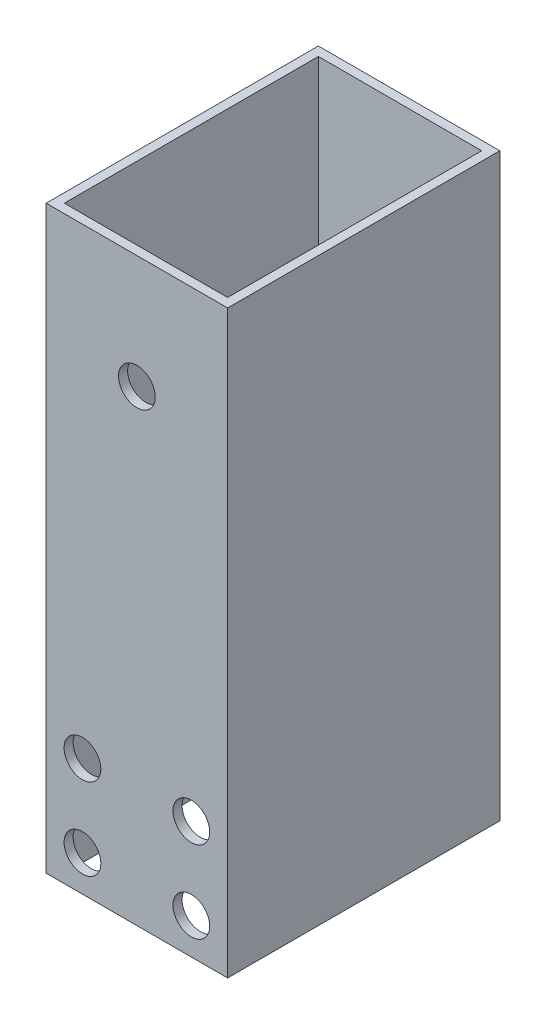
ISO-10303-21;
HEADER;
FILE_DESCRIPTION(('STEP AP214'),'2;1');
FILE_NAME('part.step','',(''),(''),'','','');
FILE_SCHEMA(('AUTOMOTIVE_DESIGN { 1 0 10303 214 1 1 1 1 }'));
ENDSEC;
DATA;
#1=APPLICATION_CONTEXT('core data for automotive mechanical design processes');
#2=APPLICATION_PROTOCOL_DEFINITION('international standard','automotive_design',2000,#1);
#3=PRODUCT_CONTEXT('',#1,'mechanical');
#4=PRODUCT('Part','Part','',(#3));
#5=PRODUCT_RELATED_PRODUCT_CATEGORY('part','',(#4));
#6=PRODUCT_DEFINITION_FORMATION('','',#4);
#7=PRODUCT_DEFINITION_CONTEXT('part definition',#1,'design');
#8=PRODUCT_DEFINITION('design','',#6,#7);
#9=PRODUCT_DEFINITION_SHAPE('','',#8);
#10=(LENGTH_UNIT() NAMED_UNIT(*) SI_UNIT(.MILLI.,.METRE.));
#11=(NAMED_UNIT(*) PLANE_ANGLE_UNIT() SI_UNIT($,.RADIAN.));
#12=(NAMED_UNIT(*) SI_UNIT($,.STERADIAN.) SOLID_ANGLE_UNIT());
#13=UNCERTAINTY_MEASURE_WITH_UNIT(LENGTH_MEASURE(1.E-05),#10,'distance_accuracy_value','');
#14=(GEOMETRIC_REPRESENTATION_CONTEXT(3) GLOBAL_UNCERTAINTY_ASSIGNED_CONTEXT((#13)) GLOBAL_UNIT_ASSIGNED_CONTEXT((#10,
#11,#12)) REPRESENTATION_CONTEXT('',''));
#15=CARTESIAN_POINT('',(0.,0.,0.));
#16=DIRECTION('',(0.,0.,1.));
#17=DIRECTION('',(1.,0.,0.));
#18=AXIS2_PLACEMENT_3D('',#15,#16,#17);
#19=CARTESIAN_POINT('',(10.,61.5,15.));
#20=DIRECTION('',(-1.,0.,0.));
#21=DIRECTION('',(0.,0.,1.));
#22=AXIS2_PLACEMENT_3D('',#19,#20,#21);
#23=PLANE('',#22);
#24=DIRECTION('',(0.,-1.,0.));
#25=VECTOR('',#24,1.);
#26=CARTESIAN_POINT('',(10.,61.5,-15.));
#27=LINE('',#26,#25);
#28=CARTESIAN_POINT('',(10.,2.45,-15.));
#29=VERTEX_POINT('',#28);
#30=CARTESIAN_POINT('',(10.,-61.5,-15.));
#31=VERTEX_POINT('',#30);
#32=EDGE_CURVE('E43',#29,#31,#27,.T.);
#33=ORIENTED_EDGE('',*,*,#32,.F.);
#34=DIRECTION('',(0.,0.,1.));
#35=VECTOR('',#34,1.);
#36=CARTESIAN_POINT('',(10.,2.45,-15.));
#37=LINE('',#36,#35);
#38=CARTESIAN_POINT('',(10.,2.45,15.));
#39=VERTEX_POINT('',#38);
#40=EDGE_CURVE('E101',#29,#39,#37,.T.);
#41=ORIENTED_EDGE('',*,*,#40,.T.);
#42=DIRECTION('',(0.,-1.,0.));
#43=VECTOR('',#42,1.);
#44=CARTESIAN_POINT('',(10.,61.5,15.));
#45=LINE('',#44,#43);
#46=CARTESIAN_POINT('',(10.,-61.5,15.));
#47=VERTEX_POINT('',#46);
#48=EDGE_CURVE('E121',#39,#47,#45,.T.);
#49=ORIENTED_EDGE('',*,*,#48,.T.);
#50=DIRECTION('',(0.,0.,-1.));
#51=VECTOR('',#50,1.);
#52=CARTESIAN_POINT('',(10.,-61.5,15.));
#53=LINE('',#52,#51);
#54=EDGE_CURVE('E193',#47,#31,#53,.T.);
#55=ORIENTED_EDGE('',*,*,#54,.T.);
#56=EDGE_LOOP('',(#33,#41,#49,#55));
#57=FACE_BOUND('',#56,.T.);
#58=ADVANCED_FACE('F35',(#57),#23,.F.);
#59=CARTESIAN_POINT('',(-10.,61.5,-15.));
#60=DIRECTION('',(0.,0.,1.));
#61=DIRECTION('',(1.,0.,0.));
#62=AXIS2_PLACEMENT_3D('',#59,#60,#61);
#63=PLANE('',#62);
#64=CARTESIAN_POINT('',(0.,-10.05,-15.));
#65=DIRECTION('',(0.,0.,1.));
#66=DIRECTION('',(1.,0.,0.));
#67=AXIS2_PLACEMENT_3D('',#64,#65,#66);
#68=CIRCLE('',#67,2.025);
#69=CARTESIAN_POINT('',(2.025,-10.05,-15.));
#70=VERTEX_POINT('',#69);
#71=EDGE_CURVE('E242',#70,#70,#68,.T.);
#72=ORIENTED_EDGE('',*,*,#71,.T.);
#73=EDGE_LOOP('',(#72));
#74=FACE_BOUND('',#73,.T.);
#75=CARTESIAN_POINT('',(-6.,-57.55,-15.));
#76=DIRECTION('',(0.,0.,1.));
#77=DIRECTION('',(1.,0.,0.));
#78=AXIS2_PLACEMENT_3D('',#75,#76,#77);
#79=CIRCLE('',#78,2.025);
#80=CARTESIAN_POINT('',(-3.975,-57.55,-15.));
#81=VERTEX_POINT('',#80);
#82=EDGE_CURVE('E137',#81,#81,#79,.T.);
#83=ORIENTED_EDGE('',*,*,#82,.T.);
#84=EDGE_LOOP('',(#83));
#85=FACE_BOUND('',#84,.T.);
#86=CARTESIAN_POINT('',(6.,-57.55,-15.));
#87=DIRECTION('',(0.,0.,1.));
#88=DIRECTION('',(1.,0.,0.));
#89=AXIS2_PLACEMENT_3D('',#86,#87,#88);
#90=CIRCLE('',#89,2.025);
#91=CARTESIAN_POINT('',(8.025,-57.55,-15.));
#92=VERTEX_POINT('',#91);
#93=EDGE_CURVE('E249',#92,#92,#90,.T.);
#94=ORIENTED_EDGE('',*,*,#93,.T.);
#95=EDGE_LOOP('',(#94));
#96=FACE_BOUND('',#95,.T.);
#97=CARTESIAN_POINT('',(-6.,-48.55,-15.));
#98=DIRECTION('',(0.,0.,1.));
#99=DIRECTION('',(1.,0.,0.));
#100=AXIS2_PLACEMENT_3D('',#97,#98,#99);
#101=CIRCLE('',#100,2.025);
#102=CARTESIAN_POINT('',(-3.975,-48.55,-15.));
#103=VERTEX_POINT('',#102);
#104=EDGE_CURVE('E129',#103,#103,#101,.T.);
#105=ORIENTED_EDGE('',*,*,#104,.T.);
#106=EDGE_LOOP('',(#105));
#107=FACE_BOUND('',#106,.T.);
#108=CARTESIAN_POINT('',(6.,-48.55,-15.));
#109=DIRECTION('',(0.,0.,1.));
#110=DIRECTION('',(1.,0.,0.));
#111=AXIS2_PLACEMENT_3D('',#108,#109,#110);
#112=CIRCLE('',#111,2.025);
#113=CARTESIAN_POINT('',(8.02500000000001,-48.55,-15.));
#114=VERTEX_POINT('',#113);
#115=EDGE_CURVE('E168',#114,#114,#112,.T.);
#116=ORIENTED_EDGE('',*,*,#115,.T.);
#117=EDGE_LOOP('',(#116));
#118=FACE_BOUND('',#117,.T.);
#119=DIRECTION('',(0.,-1.,0.));
#120=VECTOR('',#119,1.);
#121=CARTESIAN_POINT('',(-10.,61.5,-15.));
#122=LINE('',#121,#120);
#123=CARTESIAN_POINT('',(-10.,2.45,-15.));
#124=VERTEX_POINT('',#123);
#125=CARTESIAN_POINT('',(-10.,-61.5,-15.));
#126=VERTEX_POINT('',#125);
#127=EDGE_CURVE('E111',#124,#126,#122,.T.);
#128=ORIENTED_EDGE('',*,*,#127,.F.);
#129=DIRECTION('',(1.,0.,0.));
#130=VECTOR('',#129,1.);
#131=CARTESIAN_POINT('',(10.,2.45,-15.));
#132=LINE('',#131,#130);
#133=EDGE_CURVE('E98',#124,#29,#132,.T.);
#134=ORIENTED_EDGE('',*,*,#133,.T.);
#135=ORIENTED_EDGE('',*,*,#32,.T.);
#136=DIRECTION('',(-1.,0.,0.));
#137=VECTOR('',#136,1.);
#138=CARTESIAN_POINT('',(-10.,-61.5,-15.));
#139=LINE('',#138,#137);
#140=EDGE_CURVE('E117',#31,#126,#139,.T.);
#141=ORIENTED_EDGE('',*,*,#140,.T.);
#142=EDGE_LOOP('',(#128,#134,#135,#141));
#143=FACE_BOUND('',#142,.T.);
#144=ADVANCED_FACE('F115',(#74,#85,#96,#107,#118,#143),#63,.F.);
#145=CARTESIAN_POINT('',(-10.,61.5,15.));
#146=DIRECTION('',(1.,0.,0.));
#147=DIRECTION('',(0.,0.,-1.));
#148=AXIS2_PLACEMENT_3D('',#145,#146,#147);
#149=PLANE('',#148);
#150=DIRECTION('',(0.,-1.,0.));
#151=VECTOR('',#150,1.);
#152=CARTESIAN_POINT('',(-10.,61.5,15.));
#153=LINE('',#152,#151);
#154=CARTESIAN_POINT('',(-10.,2.44999999999999,15.));
#155=VERTEX_POINT('',#154);
#156=CARTESIAN_POINT('',(-10.,-61.5,15.));
#157=VERTEX_POINT('',#156);
#158=EDGE_CURVE('E113',#155,#157,#153,.T.);
#159=ORIENTED_EDGE('',*,*,#158,.F.);
#160=DIRECTION('',(0.,0.,1.));
#161=VECTOR('',#160,1.);
#162=CARTESIAN_POINT('',(-10.,2.45,-15.));
#163=LINE('',#162,#161);
#164=EDGE_CURVE('E51',#124,#155,#163,.T.);
#165=ORIENTED_EDGE('',*,*,#164,.F.);
#166=ORIENTED_EDGE('',*,*,#127,.T.);
#167=DIRECTION('',(0.,0.,1.));
#168=VECTOR('',#167,1.);
#169=CARTESIAN_POINT('',(-10.,-61.5,15.));
#170=LINE('',#169,#168);
#171=EDGE_CURVE('E205',#126,#157,#170,.T.);
#172=ORIENTED_EDGE('',*,*,#171,.T.);
#173=EDGE_LOOP('',(#159,#165,#166,#172));
#174=FACE_BOUND('',#173,.T.);
#175=ADVANCED_FACE('F109',(#174),#149,.F.);
#176=CARTESIAN_POINT('',(-10.,61.5,15.));
#177=DIRECTION('',(0.,0.,-1.));
#178=DIRECTION('',(-1.,0.,0.));
#179=AXIS2_PLACEMENT_3D('',#176,#177,#178);
#180=PLANE('',#179);
#181=CARTESIAN_POINT('',(0.,-10.05,15.));
#182=DIRECTION('',(0.,0.,1.));
#183=DIRECTION('',(1.,0.,0.));
#184=AXIS2_PLACEMENT_3D('',#181,#182,#183);
#185=CIRCLE('',#184,2.025);
#186=CARTESIAN_POINT('',(2.025,-10.05,15.));
#187=VERTEX_POINT('',#186);
#188=EDGE_CURVE('E427',#187,#187,#185,.T.);
#189=ORIENTED_EDGE('',*,*,#188,.F.);
#190=EDGE_LOOP('',(#189));
#191=FACE_BOUND('',#190,.T.);
#192=CARTESIAN_POINT('',(-6.,-57.55,15.));
#193=DIRECTION('',(0.,0.,1.));
#194=DIRECTION('',(1.,0.,0.));
#195=AXIS2_PLACEMENT_3D('',#192,#193,#194);
#196=CIRCLE('',#195,2.025);
#197=CARTESIAN_POINT('',(-3.975,-57.55,15.));
#198=VERTEX_POINT('',#197);
#199=EDGE_CURVE('E438',#198,#198,#196,.T.);
#200=ORIENTED_EDGE('',*,*,#199,.F.);
#201=EDGE_LOOP('',(#200));
#202=FACE_BOUND('',#201,.T.);
#203=CARTESIAN_POINT('',(6.,-57.55,15.));
#204=DIRECTION('',(0.,0.,1.));
#205=DIRECTION('',(1.,0.,0.));
#206=AXIS2_PLACEMENT_3D('',#203,#204,#205);
#207=CIRCLE('',#206,2.025);
#208=CARTESIAN_POINT('',(8.025,-57.55,15.));
#209=VERTEX_POINT('',#208);
#210=EDGE_CURVE('E150',#209,#209,#207,.T.);
#211=ORIENTED_EDGE('',*,*,#210,.F.);
#212=EDGE_LOOP('',(#211));
#213=FACE_BOUND('',#212,.T.);
#214=CARTESIAN_POINT('',(-6.,-48.55,15.));
#215=DIRECTION('',(0.,0.,1.));
#216=DIRECTION('',(1.,0.,0.));
#217=AXIS2_PLACEMENT_3D('',#214,#215,#216);
#218=CIRCLE('',#217,2.025);
#219=CARTESIAN_POINT('',(-3.975,-48.55,15.));
#220=VERTEX_POINT('',#219);
#221=EDGE_CURVE('E165',#220,#220,#218,.T.);
#222=ORIENTED_EDGE('',*,*,#221,.F.);
#223=EDGE_LOOP('',(#222));
#224=FACE_BOUND('',#223,.T.);
#225=CARTESIAN_POINT('',(6.,-48.55,15.));
#226=DIRECTION('',(0.,0.,1.));
#227=DIRECTION('',(1.,0.,0.));
#228=AXIS2_PLACEMENT_3D('',#225,#226,#227);
#229=CIRCLE('',#228,2.025);
#230=CARTESIAN_POINT('',(8.02500000000001,-48.55,15.));
#231=VERTEX_POINT('',#230);
#232=EDGE_CURVE('E162',#231,#231,#229,.T.);
#233=ORIENTED_EDGE('',*,*,#232,.F.);
#234=EDGE_LOOP('',(#233));
#235=FACE_BOUND('',#234,.T.);
#236=ORIENTED_EDGE('',*,*,#48,.F.);
#237=DIRECTION('',(1.,0.,0.));
#238=VECTOR('',#237,1.);
#239=CARTESIAN_POINT('',(10.,2.45,15.));
#240=LINE('',#239,#238);
#241=EDGE_CURVE('E105',#155,#39,#240,.T.);
#242=ORIENTED_EDGE('',*,*,#241,.F.);
#243=ORIENTED_EDGE('',*,*,#158,.T.);
#244=DIRECTION('',(1.,0.,0.));
#245=VECTOR('',#244,1.);
#246=CARTESIAN_POINT('',(-10.,-61.5,15.));
#247=LINE('',#246,#245);
#248=EDGE_CURVE('E207',#157,#47,#247,.T.);
#249=ORIENTED_EDGE('',*,*,#248,.T.);
#250=EDGE_LOOP('',(#236,#242,#243,#249));
#251=FACE_BOUND('',#250,.T.);
#252=ADVANCED_FACE('F214',(#191,#202,#213,#224,#235,#251),#180,.F.);
#253=CARTESIAN_POINT('',(0.,-61.5,0.));
#254=DIRECTION('',(0.,-1.,0.));
#255=DIRECTION('',(0.,0.,-1.));
#256=AXIS2_PLACEMENT_3D('',#253,#254,#255);
#257=PLANE('',#256);
#258=DIRECTION('',(1.,0.,0.));
#259=VECTOR('',#258,1.);
#260=CARTESIAN_POINT('',(-9.,-61.5,14.));
#261=LINE('',#260,#259);
#262=CARTESIAN_POINT('',(-9.,-61.5,14.));
#263=VERTEX_POINT('',#262);
#264=CARTESIAN_POINT('',(9.,-61.5,14.));
#265=VERTEX_POINT('',#264);
#266=EDGE_CURVE('E177',#263,#265,#261,.T.);
#267=ORIENTED_EDGE('',*,*,#266,.T.);
#268=DIRECTION('',(0.,0.,-1.));
#269=VECTOR('',#268,1.);
#270=CARTESIAN_POINT('',(9.,-61.5,14.));
#271=LINE('',#270,#269);
#272=CARTESIAN_POINT('',(9.,-61.5,-14.));
#273=VERTEX_POINT('',#272);
#274=EDGE_CURVE('E180',#265,#273,#271,.T.);
#275=ORIENTED_EDGE('',*,*,#274,.T.);
#276=DIRECTION('',(-1.,0.,0.));
#277=VECTOR('',#276,1.);
#278=CARTESIAN_POINT('',(9.,-61.5,-14.));
#279=LINE('',#278,#277);
#280=CARTESIAN_POINT('',(-9.,-61.5,-14.));
#281=VERTEX_POINT('',#280);
#282=EDGE_CURVE('E183',#273,#281,#279,.T.);
#283=ORIENTED_EDGE('',*,*,#282,.T.);
#284=DIRECTION('',(0.,0.,1.));
#285=VECTOR('',#284,1.);
#286=CARTESIAN_POINT('',(-9.,-61.5,-14.));
#287=LINE('',#286,#285);
#288=EDGE_CURVE('E186',#281,#263,#287,.T.);
#289=ORIENTED_EDGE('',*,*,#288,.T.);
#290=EDGE_LOOP('',(#267,#275,#283,#289));
#291=FACE_BOUND('',#290,.T.);
#292=ORIENTED_EDGE('',*,*,#54,.F.);
#293=ORIENTED_EDGE('',*,*,#248,.F.);
#294=ORIENTED_EDGE('',*,*,#171,.F.);
#295=ORIENTED_EDGE('',*,*,#140,.F.);
#296=EDGE_LOOP('',(#292,#293,#294,#295));
#297=FACE_BOUND('',#296,.T.);
#298=ADVANCED_FACE('F216',(#291,#297),#257,.T.);
#299=CARTESIAN_POINT('',(-9.,-61.5,14.));
#300=DIRECTION('',(0.,0.,1.));
#301=DIRECTION('',(1.,0.,0.));
#302=AXIS2_PLACEMENT_3D('',#299,#300,#301);
#303=PLANE('',#302);
#304=CARTESIAN_POINT('',(0.,-10.05,14.));
#305=DIRECTION('',(0.,0.,1.));
#306=DIRECTION('',(1.,0.,0.));
#307=AXIS2_PLACEMENT_3D('',#304,#305,#306);
#308=CIRCLE('',#307,2.025);
#309=CARTESIAN_POINT('',(2.025,-10.05,14.));
#310=VERTEX_POINT('',#309);
#311=EDGE_CURVE('E430',#310,#310,#308,.T.);
#312=ORIENTED_EDGE('',*,*,#311,.T.);
#313=EDGE_LOOP('',(#312));
#314=FACE_BOUND('',#313,.T.);
#315=CARTESIAN_POINT('',(-6.,-57.55,14.));
#316=DIRECTION('',(0.,0.,1.));
#317=DIRECTION('',(1.,0.,0.));
#318=AXIS2_PLACEMENT_3D('',#315,#316,#317);
#319=CIRCLE('',#318,2.025);
#320=CARTESIAN_POINT('',(-3.975,-57.55,14.));
#321=VERTEX_POINT('',#320);
#322=EDGE_CURVE('E140',#321,#321,#319,.T.);
#323=ORIENTED_EDGE('',*,*,#322,.T.);
#324=EDGE_LOOP('',(#323));
#325=FACE_BOUND('',#324,.T.);
#326=CARTESIAN_POINT('',(6.,-57.55,14.));
#327=DIRECTION('',(0.,0.,1.));
#328=DIRECTION('',(1.,0.,0.));
#329=AXIS2_PLACEMENT_3D('',#326,#327,#328);
#330=CIRCLE('',#329,2.025);
#331=CARTESIAN_POINT('',(8.025,-57.55,14.));
#332=VERTEX_POINT('',#331);
#333=EDGE_CURVE('E136',#332,#332,#330,.T.);
#334=ORIENTED_EDGE('',*,*,#333,.T.);
#335=EDGE_LOOP('',(#334));
#336=FACE_BOUND('',#335,.T.);
#337=CARTESIAN_POINT('',(-6.,-48.55,14.));
#338=DIRECTION('',(0.,0.,1.));
#339=DIRECTION('',(1.,0.,0.));
#340=AXIS2_PLACEMENT_3D('',#337,#338,#339);
#341=CIRCLE('',#340,2.025);
#342=CARTESIAN_POINT('',(-3.975,-48.55,14.));
#343=VERTEX_POINT('',#342);
#344=EDGE_CURVE('E132',#343,#343,#341,.T.);
#345=ORIENTED_EDGE('',*,*,#344,.T.);
#346=EDGE_LOOP('',(#345));
#347=FACE_BOUND('',#346,.T.);
#348=CARTESIAN_POINT('',(6.,-48.55,14.));
#349=DIRECTION('',(0.,0.,1.));
#350=DIRECTION('',(1.,0.,0.));
#351=AXIS2_PLACEMENT_3D('',#348,#349,#350);
#352=CIRCLE('',#351,2.025);
#353=CARTESIAN_POINT('',(8.02500000000001,-48.55,14.));
#354=VERTEX_POINT('',#353);
#355=EDGE_CURVE('E128',#354,#354,#352,.T.);
#356=ORIENTED_EDGE('',*,*,#355,.T.);
#357=EDGE_LOOP('',(#356));
#358=FACE_BOUND('',#357,.T.);
#359=DIRECTION('',(0.,1.,0.));
#360=VECTOR('',#359,1.);
#361=CARTESIAN_POINT('',(-9.,-61.5,14.));
#362=LINE('',#361,#360);
#363=CARTESIAN_POINT('',(-9.,2.44999999999999,14.));
#364=VERTEX_POINT('',#363);
#365=EDGE_CURVE('E190',#263,#364,#362,.T.);
#366=ORIENTED_EDGE('',*,*,#365,.T.);
#367=DIRECTION('',(1.,0.,0.));
#368=VECTOR('',#367,1.);
#369=CARTESIAN_POINT('',(-9.00000000000001,2.44999999999999,14.));
#370=LINE('',#369,#368);
#371=CARTESIAN_POINT('',(9.,2.44999999999999,14.));
#372=VERTEX_POINT('',#371);
#373=EDGE_CURVE('E159',#364,#372,#370,.T.);
#374=ORIENTED_EDGE('',*,*,#373,.T.);
#375=DIRECTION('',(0.,1.,0.));
#376=VECTOR('',#375,1.);
#377=CARTESIAN_POINT('',(9.,-61.5,14.));
#378=LINE('',#377,#376);
#379=EDGE_CURVE('E189',#265,#372,#378,.T.);
#380=ORIENTED_EDGE('',*,*,#379,.F.);
#381=ORIENTED_EDGE('',*,*,#266,.F.);
#382=EDGE_LOOP('',(#366,#374,#380,#381));
#383=FACE_BOUND('',#382,.T.);
#384=ADVANCED_FACE('F218',(#314,#325,#336,#347,#358,#383),#303,.F.);
#385=CARTESIAN_POINT('',(-9.,-61.5,-14.));
#386=DIRECTION('',(-1.,0.,0.));
#387=DIRECTION('',(0.,0.,1.));
#388=AXIS2_PLACEMENT_3D('',#385,#386,#387);
#389=PLANE('',#388);
#390=DIRECTION('',(0.,1.,0.));
#391=VECTOR('',#390,1.);
#392=CARTESIAN_POINT('',(-9.,-61.5,-14.));
#393=LINE('',#392,#391);
#394=CARTESIAN_POINT('',(-9.,2.44999999999999,-14.));
#395=VERTEX_POINT('',#394);
#396=EDGE_CURVE('E194',#281,#395,#393,.T.);
#397=ORIENTED_EDGE('',*,*,#396,.T.);
#398=DIRECTION('',(0.,0.,1.));
#399=VECTOR('',#398,1.);
#400=CARTESIAN_POINT('',(-9.,2.44999999999999,-14.));
#401=LINE('',#400,#399);
#402=EDGE_CURVE('E156',#395,#364,#401,.T.);
#403=ORIENTED_EDGE('',*,*,#402,.T.);
#404=ORIENTED_EDGE('',*,*,#365,.F.);
#405=ORIENTED_EDGE('',*,*,#288,.F.);
#406=EDGE_LOOP('',(#397,#403,#404,#405));
#407=FACE_BOUND('',#406,.T.);
#408=ADVANCED_FACE('F225',(#407),#389,.F.);
#409=CARTESIAN_POINT('',(9.,-61.5,-14.));
#410=DIRECTION('',(0.,0.,-1.));
#411=DIRECTION('',(-1.,0.,0.));
#412=AXIS2_PLACEMENT_3D('',#409,#410,#411);
#413=PLANE('',#412);
#414=CARTESIAN_POINT('',(0.,-10.05,-14.));
#415=DIRECTION('',(0.,0.,-1.));
#416=DIRECTION('',(-1.,0.,0.));
#417=AXIS2_PLACEMENT_3D('',#414,#415,#416);
#418=CIRCLE('',#417,2.025);
#419=CARTESIAN_POINT('',(-2.025,-10.05,-14.));
#420=VERTEX_POINT('',#419);
#421=EDGE_CURVE('E38',#420,#420,#418,.T.);
#422=ORIENTED_EDGE('',*,*,#421,.T.);
#423=EDGE_LOOP('',(#422));
#424=FACE_BOUND('',#423,.T.);
#425=CARTESIAN_POINT('',(-6.,-57.55,-14.));
#426=DIRECTION('',(0.,0.,-1.));
#427=DIRECTION('',(-1.,0.,0.));
#428=AXIS2_PLACEMENT_3D('',#425,#426,#427);
#429=CIRCLE('',#428,2.025);
#430=CARTESIAN_POINT('',(-8.025,-57.55,-14.));
#431=VERTEX_POINT('',#430);
#432=EDGE_CURVE('E138',#431,#431,#429,.T.);
#433=ORIENTED_EDGE('',*,*,#432,.T.);
#434=EDGE_LOOP('',(#433));
#435=FACE_BOUND('',#434,.T.);
#436=CARTESIAN_POINT('',(6.,-57.55,-14.));
#437=DIRECTION('',(0.,0.,-1.));
#438=DIRECTION('',(-1.,0.,0.));
#439=AXIS2_PLACEMENT_3D('',#436,#437,#438);
#440=CIRCLE('',#439,2.025);
#441=CARTESIAN_POINT('',(3.975,-57.55,-14.));
#442=VERTEX_POINT('',#441);
#443=EDGE_CURVE('E134',#442,#442,#440,.T.);
#444=ORIENTED_EDGE('',*,*,#443,.T.);
#445=EDGE_LOOP('',(#444));
#446=FACE_BOUND('',#445,.T.);
#447=CARTESIAN_POINT('',(-6.,-48.55,-14.));
#448=DIRECTION('',(0.,0.,-1.));
#449=DIRECTION('',(-1.,0.,0.));
#450=AXIS2_PLACEMENT_3D('',#447,#448,#449);
#451=CIRCLE('',#450,2.025);
#452=CARTESIAN_POINT('',(-8.02500000000001,-48.55,-14.));
#453=VERTEX_POINT('',#452);
#454=EDGE_CURVE('E130',#453,#453,#451,.T.);
#455=ORIENTED_EDGE('',*,*,#454,.T.);
#456=EDGE_LOOP('',(#455));
#457=FACE_BOUND('',#456,.T.);
#458=CARTESIAN_POINT('',(6.,-48.55,-14.));
#459=DIRECTION('',(0.,0.,-1.));
#460=DIRECTION('',(-1.,0.,0.));
#461=AXIS2_PLACEMENT_3D('',#458,#459,#460);
#462=CIRCLE('',#461,2.025);
#463=CARTESIAN_POINT('',(3.975,-48.55,-14.));
#464=VERTEX_POINT('',#463);
#465=EDGE_CURVE('E125',#464,#464,#462,.T.);
#466=ORIENTED_EDGE('',*,*,#465,.T.);
#467=EDGE_LOOP('',(#466));
#468=FACE_BOUND('',#467,.T.);
#469=DIRECTION('',(0.,1.,0.));
#470=VECTOR('',#469,1.);
#471=CARTESIAN_POINT('',(9.,-61.5,-14.));
#472=LINE('',#471,#470);
#473=CARTESIAN_POINT('',(9.,2.44999999999999,-14.));
#474=VERTEX_POINT('',#473);
#475=EDGE_CURVE('E197',#273,#474,#472,.T.);
#476=ORIENTED_EDGE('',*,*,#475,.T.);
#477=DIRECTION('',(-1.,0.,0.));
#478=VECTOR('',#477,1.);
#479=CARTESIAN_POINT('',(8.99999999999999,2.44999999999999,-14.));
#480=LINE('',#479,#478);
#481=EDGE_CURVE('E59',#474,#395,#480,.T.);
#482=ORIENTED_EDGE('',*,*,#481,.T.);
#483=ORIENTED_EDGE('',*,*,#396,.F.);
#484=ORIENTED_EDGE('',*,*,#282,.F.);
#485=EDGE_LOOP('',(#476,#482,#483,#484));
#486=FACE_BOUND('',#485,.T.);
#487=ADVANCED_FACE('F263',(#424,#435,#446,#457,#468,#486),#413,.F.);
#488=CARTESIAN_POINT('',(9.,-61.5,14.));
#489=DIRECTION('',(1.,0.,0.));
#490=DIRECTION('',(0.,0.,-1.));
#491=AXIS2_PLACEMENT_3D('',#488,#489,#490);
#492=PLANE('',#491);
#493=ORIENTED_EDGE('',*,*,#379,.T.);
#494=DIRECTION('',(0.,0.,-1.));
#495=VECTOR('',#494,1.);
#496=CARTESIAN_POINT('',(9.,2.44999999999999,14.));
#497=LINE('',#496,#495);
#498=EDGE_CURVE('E11',#372,#474,#497,.T.);
#499=ORIENTED_EDGE('',*,*,#498,.T.);
#500=ORIENTED_EDGE('',*,*,#475,.F.);
#501=ORIENTED_EDGE('',*,*,#274,.F.);
#502=EDGE_LOOP('',(#493,#499,#500,#501));
#503=FACE_BOUND('',#502,.T.);
#504=ADVANCED_FACE('F258',(#503),#492,.F.);
#505=CARTESIAN_POINT('',(6.,-48.55,-15.));
#506=DIRECTION('',(0.,0.,1.));
#507=DIRECTION('',(1.,0.,0.));
#508=AXIS2_PLACEMENT_3D('',#505,#506,#507);
#509=CYLINDRICAL_SURFACE('',#508,2.025);
#510=ORIENTED_EDGE('',*,*,#115,.F.);
#511=EDGE_LOOP('',(#510));
#512=FACE_BOUND('',#511,.T.);
#513=ORIENTED_EDGE('',*,*,#465,.F.);
#514=EDGE_LOOP('',(#513));
#515=FACE_BOUND('',#514,.T.);
#516=ADVANCED_FACE('F254',(#512,#515),#509,.F.);
#517=CARTESIAN_POINT('',(-6.,-48.55,-15.));
#518=DIRECTION('',(0.,0.,1.));
#519=DIRECTION('',(1.,0.,0.));
#520=AXIS2_PLACEMENT_3D('',#517,#518,#519);
#521=CYLINDRICAL_SURFACE('',#520,2.025);
#522=ORIENTED_EDGE('',*,*,#104,.F.);
#523=EDGE_LOOP('',(#522));
#524=FACE_BOUND('',#523,.T.);
#525=ORIENTED_EDGE('',*,*,#454,.F.);
#526=EDGE_LOOP('',(#525));
#527=FACE_BOUND('',#526,.T.);
#528=ADVANCED_FACE('F257',(#524,#527),#521,.F.);
#529=ORIENTED_EDGE('',*,*,#232,.T.);
#530=EDGE_LOOP('',(#529));
#531=FACE_BOUND('',#530,.T.);
#532=ORIENTED_EDGE('',*,*,#355,.F.);
#533=EDGE_LOOP('',(#532));
#534=FACE_BOUND('',#533,.T.);
#535=ADVANCED_FACE('F260',(#531,#534),#509,.F.);
#536=ORIENTED_EDGE('',*,*,#221,.T.);
#537=EDGE_LOOP('',(#536));
#538=FACE_BOUND('',#537,.T.);
#539=ORIENTED_EDGE('',*,*,#344,.F.);
#540=EDGE_LOOP('',(#539));
#541=FACE_BOUND('',#540,.T.);
#542=ADVANCED_FACE('F298',(#538,#541),#521,.F.);
#543=CARTESIAN_POINT('',(10.,2.45,-15.));
#544=DIRECTION('',(0.,-1.,0.));
#545=DIRECTION('',(1.,0.,0.));
#546=AXIS2_PLACEMENT_3D('',#543,#544,#545);
#547=PLANE('',#546);
#548=ORIENTED_EDGE('',*,*,#241,.T.);
#549=ORIENTED_EDGE('',*,*,#40,.F.);
#550=ORIENTED_EDGE('',*,*,#133,.F.);
#551=ORIENTED_EDGE('',*,*,#164,.T.);
#552=EDGE_LOOP('',(#548,#549,#550,#551));
#553=FACE_BOUND('',#552,.T.);
#554=ORIENTED_EDGE('',*,*,#402,.F.);
#555=ORIENTED_EDGE('',*,*,#481,.F.);
#556=ORIENTED_EDGE('',*,*,#498,.F.);
#557=ORIENTED_EDGE('',*,*,#373,.F.);
#558=EDGE_LOOP('',(#554,#555,#556,#557));
#559=FACE_BOUND('',#558,.T.);
#560=ADVANCED_FACE('F99',(#553,#559),#547,.F.);
#561=CARTESIAN_POINT('',(6.,-57.55,-15.));
#562=DIRECTION('',(0.,0.,1.));
#563=DIRECTION('',(1.,0.,0.));
#564=AXIS2_PLACEMENT_3D('',#561,#562,#563);
#565=CYLINDRICAL_SURFACE('',#564,2.025);
#566=ORIENTED_EDGE('',*,*,#93,.F.);
#567=EDGE_LOOP('',(#566));
#568=FACE_BOUND('',#567,.T.);
#569=ORIENTED_EDGE('',*,*,#443,.F.);
#570=EDGE_LOOP('',(#569));
#571=FACE_BOUND('',#570,.T.);
#572=ADVANCED_FACE('F315',(#568,#571),#565,.F.);
#573=CARTESIAN_POINT('',(-6.,-57.55,-15.));
#574=DIRECTION('',(0.,0.,1.));
#575=DIRECTION('',(1.,0.,0.));
#576=AXIS2_PLACEMENT_3D('',#573,#574,#575);
#577=CYLINDRICAL_SURFACE('',#576,2.025);
#578=ORIENTED_EDGE('',*,*,#82,.F.);
#579=EDGE_LOOP('',(#578));
#580=FACE_BOUND('',#579,.T.);
#581=ORIENTED_EDGE('',*,*,#432,.F.);
#582=EDGE_LOOP('',(#581));
#583=FACE_BOUND('',#582,.T.);
#584=ADVANCED_FACE('F322',(#580,#583),#577,.F.);
#585=ORIENTED_EDGE('',*,*,#210,.T.);
#586=EDGE_LOOP('',(#585));
#587=FACE_BOUND('',#586,.T.);
#588=ORIENTED_EDGE('',*,*,#333,.F.);
#589=EDGE_LOOP('',(#588));
#590=FACE_BOUND('',#589,.T.);
#591=ADVANCED_FACE('F325',(#587,#590),#565,.F.);
#592=ORIENTED_EDGE('',*,*,#199,.T.);
#593=EDGE_LOOP('',(#592));
#594=FACE_BOUND('',#593,.T.);
#595=ORIENTED_EDGE('',*,*,#322,.F.);
#596=EDGE_LOOP('',(#595));
#597=FACE_BOUND('',#596,.T.);
#598=ADVANCED_FACE('F333',(#594,#597),#577,.F.);
#599=CARTESIAN_POINT('',(0.,-10.05,-15.));
#600=DIRECTION('',(0.,0.,1.));
#601=DIRECTION('',(1.,0.,0.));
#602=AXIS2_PLACEMENT_3D('',#599,#600,#601);
#603=CYLINDRICAL_SURFACE('',#602,2.025);
#604=ORIENTED_EDGE('',*,*,#71,.F.);
#605=EDGE_LOOP('',(#604));
#606=FACE_BOUND('',#605,.T.);
#607=ORIENTED_EDGE('',*,*,#421,.F.);
#608=EDGE_LOOP('',(#607));
#609=FACE_BOUND('',#608,.T.);
#610=ADVANCED_FACE('F345',(#606,#609),#603,.F.);
#611=ORIENTED_EDGE('',*,*,#188,.T.);
#612=EDGE_LOOP('',(#611));
#613=FACE_BOUND('',#612,.T.);
#614=ORIENTED_EDGE('',*,*,#311,.F.);
#615=EDGE_LOOP('',(#614));
#616=FACE_BOUND('',#615,.T.);
#617=ADVANCED_FACE('F352',(#613,#616),#603,.F.);
#618=CLOSED_SHELL('',(#58,#144,#175,#252,#298,#384,#408,#487,#504,#516,#528,#535,#542,#560,#572,
#584,#591,#598,#610,#617));
#619=MANIFOLD_SOLID_BREP('B2',#618);
#620=ADVANCED_BREP_SHAPE_REPRESENTATION('',(#18,#619),#14);
#621=SHAPE_DEFINITION_REPRESENTATION(#9,#620);
ENDSEC;
END-ISO-10303-21;
